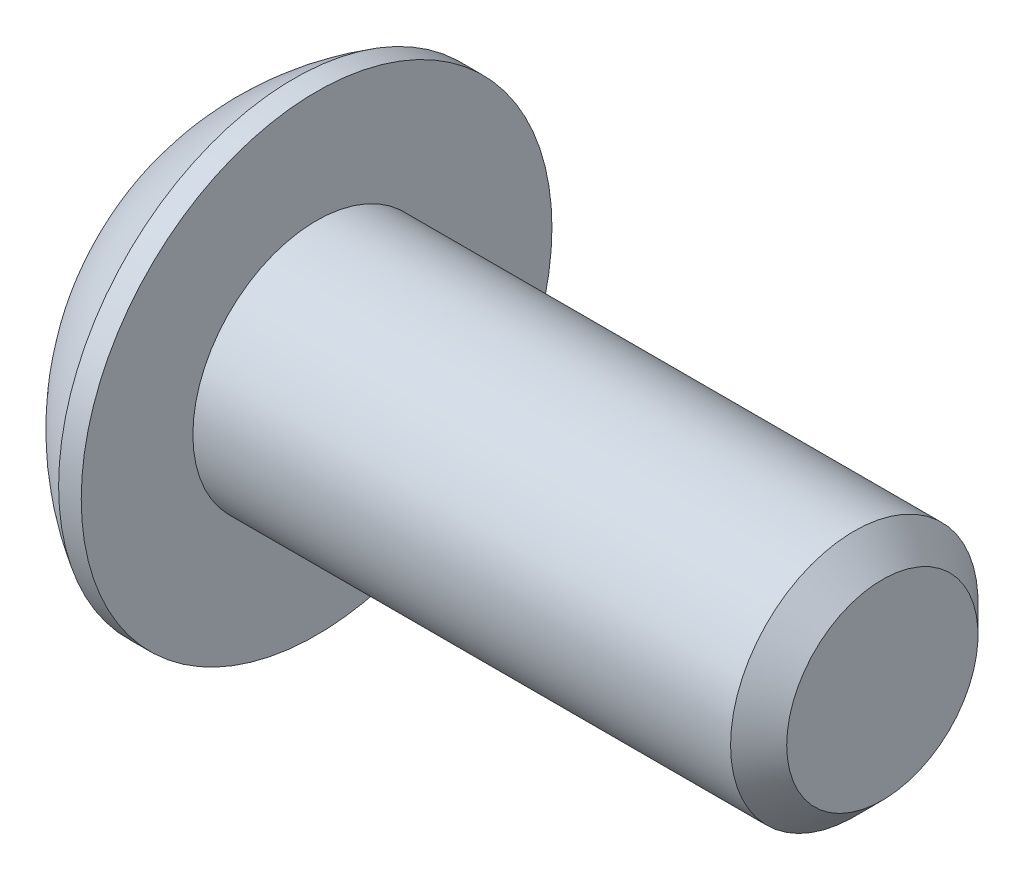
ISO-10303-21;
HEADER;
FILE_DESCRIPTION(('STEP AP214'),'2;1');
FILE_NAME('part.step','',(''),(''),'','','');
FILE_SCHEMA(('AUTOMOTIVE_DESIGN { 1 0 10303 214 1 1 1 1 }'));
ENDSEC;
DATA;
#1=APPLICATION_CONTEXT('core data for automotive mechanical design processes');
#2=APPLICATION_PROTOCOL_DEFINITION('international standard','automotive_design',2000,#1);
#3=PRODUCT_CONTEXT('',#1,'mechanical');
#4=PRODUCT('Part','Part','',(#3));
#5=PRODUCT_RELATED_PRODUCT_CATEGORY('part','',(#4));
#6=PRODUCT_DEFINITION_FORMATION('','',#4);
#7=PRODUCT_DEFINITION_CONTEXT('part definition',#1,'design');
#8=PRODUCT_DEFINITION('design','',#6,#7);
#9=PRODUCT_DEFINITION_SHAPE('','',#8);
#10=(LENGTH_UNIT() NAMED_UNIT(*) SI_UNIT(.MILLI.,.METRE.));
#11=(NAMED_UNIT(*) PLANE_ANGLE_UNIT() SI_UNIT($,.RADIAN.));
#12=(NAMED_UNIT(*) SI_UNIT($,.STERADIAN.) SOLID_ANGLE_UNIT());
#13=UNCERTAINTY_MEASURE_WITH_UNIT(LENGTH_MEASURE(1.E-05),#10,'distance_accuracy_value','');
#14=(GEOMETRIC_REPRESENTATION_CONTEXT(3) GLOBAL_UNCERTAINTY_ASSIGNED_CONTEXT((#13)) GLOBAL_UNIT_ASSIGNED_CONTEXT((#10,
#11,#12)) REPRESENTATION_CONTEXT('',''));
#15=CARTESIAN_POINT('',(0.,0.,0.));
#16=DIRECTION('',(0.,0.,1.));
#17=DIRECTION('',(1.,0.,0.));
#18=AXIS2_PLACEMENT_3D('',#15,#16,#17);
#19=CARTESIAN_POINT('',(1.32079999997359,0.,0.));
#20=DIRECTION('',(-1.,0.,0.));
#21=DIRECTION('',(0.,0.,1.));
#22=AXIS2_PLACEMENT_3D('',#19,#20,#21);
#23=CONICAL_SURFACE('',#22,1.19380000001001,1.04719755119008);
#24=CARTESIAN_POINT('',(2.0100407513155,0.,0.));
#25=VERTEX_POINT('',#24);
#26=VERTEX_LOOP('',#25);
#27=FACE_BOUND('',#26,.T.);
#28=CARTESIAN_POINT('',(1.32079999997359,0.,0.));
#29=DIRECTION('',(-1.,0.,0.));
#30=DIRECTION('',(0.,0.,1.));
#31=AXIS2_PLACEMENT_3D('',#28,#29,#30);
#32=CIRCLE('',#31,1.19380000001001);
#33=CARTESIAN_POINT('',(1.32079999998682,-1.0338611270422,0.596900000002503));
#34=VERTEX_POINT('',#33);
#35=CARTESIAN_POINT('',(1.32079999998682,0.,1.19380000000501));
#36=VERTEX_POINT('',#35);
#37=EDGE_CURVE('E92',#34,#36,#32,.T.);
#38=ORIENTED_EDGE('',*,*,#37,.T.);
#39=CARTESIAN_POINT('',(1.32079999997359,0.,0.));
#40=DIRECTION('',(-1.,0.,0.));
#41=DIRECTION('',(0.,0.,1.));
#42=AXIS2_PLACEMENT_3D('',#39,#40,#41);
#43=CIRCLE('',#42,1.19380000001001);
#44=CARTESIAN_POINT('',(1.32079999998682,1.0338611270422,0.596900000002504));
#45=VERTEX_POINT('',#44);
#46=EDGE_CURVE('E88',#36,#45,#43,.T.);
#47=ORIENTED_EDGE('',*,*,#46,.T.);
#48=CARTESIAN_POINT('',(1.32079999997359,0.,0.));
#49=DIRECTION('',(-1.,0.,0.));
#50=DIRECTION('',(0.,0.,1.));
#51=AXIS2_PLACEMENT_3D('',#48,#49,#50);
#52=CIRCLE('',#51,1.19380000001001);
#53=CARTESIAN_POINT('',(1.32079999998682,1.0338611270422,-0.596900000002504));
#54=VERTEX_POINT('',#53);
#55=EDGE_CURVE('E21',#45,#54,#52,.T.);
#56=ORIENTED_EDGE('',*,*,#55,.T.);
#57=CARTESIAN_POINT('',(1.32079999997359,0.,0.));
#58=DIRECTION('',(-1.,0.,0.));
#59=DIRECTION('',(0.,0.,1.));
#60=AXIS2_PLACEMENT_3D('',#57,#58,#59);
#61=CIRCLE('',#60,1.19380000001001);
#62=CARTESIAN_POINT('',(1.32079999998682,1.49461108489558E-12,-1.19380000000501));
#63=VERTEX_POINT('',#62);
#64=EDGE_CURVE('E151',#54,#63,#61,.T.);
#65=ORIENTED_EDGE('',*,*,#64,.T.);
#66=CARTESIAN_POINT('',(1.32079999997359,0.,0.));
#67=DIRECTION('',(-1.,0.,0.));
#68=DIRECTION('',(0.,0.,1.));
#69=AXIS2_PLACEMENT_3D('',#66,#67,#68);
#70=CIRCLE('',#69,1.19380000001001);
#71=CARTESIAN_POINT('',(1.32079999998682,-1.0338611270422,-0.596900000002503));
#72=VERTEX_POINT('',#71);
#73=EDGE_CURVE('E153',#63,#72,#70,.T.);
#74=ORIENTED_EDGE('',*,*,#73,.T.);
#75=CARTESIAN_POINT('',(1.32079999997359,0.,0.));
#76=DIRECTION('',(-1.,0.,0.));
#77=DIRECTION('',(0.,0.,1.));
#78=AXIS2_PLACEMENT_3D('',#75,#76,#77);
#79=CIRCLE('',#78,1.19380000001001);
#80=EDGE_CURVE('E155',#72,#34,#79,.T.);
#81=ORIENTED_EDGE('',*,*,#80,.T.);
#82=EDGE_LOOP('',(#38,#47,#56,#65,#74,#81));
#83=FACE_BOUND('',#82,.T.);
#84=ADVANCED_FACE('F17',(#27,#83),#23,.F.);
#85=CARTESIAN_POINT('',(1.3208,-2.06772225407572,-1.1938));
#86=DIRECTION('',(1.,0.,0.));
#87=DIRECTION('',(0.,0.,-1.));
#88=AXIS2_PLACEMENT_3D('',#85,#86,#87);
#89=PLANE('',#88);
#90=DIRECTION('',(0.,-0.5,-0.866025403784439));
#91=VECTOR('',#90,1.);
#92=CARTESIAN_POINT('',(1.32080000000004,1.37848150271715,0.));
#93=LINE('',#92,#91);
#94=CARTESIAN_POINT('',(1.32080000000001,1.37848150271715,0.));
#95=VERTEX_POINT('',#94);
#96=EDGE_CURVE('E104',#54,#95,#93,.F.);
#97=ORIENTED_EDGE('',*,*,#96,.F.);
#98=ORIENTED_EDGE('',*,*,#55,.F.);
#99=DIRECTION('',(0.,0.5,-0.866025403784439));
#100=VECTOR('',#99,1.);
#101=CARTESIAN_POINT('',(1.3208,0.689240751358576,1.1938));
#102=LINE('',#101,#100);
#103=EDGE_CURVE('E102',#95,#45,#102,.F.);
#104=ORIENTED_EDGE('',*,*,#103,.F.);
#105=EDGE_LOOP('',(#97,#98,#104));
#106=FACE_BOUND('',#105,.T.);
#107=ADVANCED_FACE('F100',(#106),#89,.F.);
#108=CARTESIAN_POINT('',(1.3208,-2.06772225407572,-1.1938));
#109=DIRECTION('',(1.,0.,0.));
#110=DIRECTION('',(0.,0.,-1.));
#111=AXIS2_PLACEMENT_3D('',#108,#109,#110);
#112=PLANE('',#111);
#113=DIRECTION('',(0.,0.5,-0.866025403784439));
#114=VECTOR('',#113,1.);
#115=CARTESIAN_POINT('',(1.32080000000004,0.689240751358576,1.1938));
#116=LINE('',#115,#114);
#117=CARTESIAN_POINT('',(1.32080000000001,0.689240751358576,1.1938));
#118=VERTEX_POINT('',#117);
#119=EDGE_CURVE('E106',#45,#118,#116,.F.);
#120=ORIENTED_EDGE('',*,*,#119,.F.);
#121=ORIENTED_EDGE('',*,*,#46,.F.);
#122=DIRECTION('',(0.,1.,0.));
#123=VECTOR('',#122,1.);
#124=CARTESIAN_POINT('',(1.3208,-0.689240751358574,1.1938));
#125=LINE('',#124,#123);
#126=EDGE_CURVE('E109',#118,#36,#125,.F.);
#127=ORIENTED_EDGE('',*,*,#126,.F.);
#128=EDGE_LOOP('',(#120,#121,#127));
#129=FACE_BOUND('',#128,.T.);
#130=ADVANCED_FACE('F107',(#129),#112,.F.);
#131=CARTESIAN_POINT('',(1.3208,-2.06772225407572,-1.1938));
#132=DIRECTION('',(1.,0.,0.));
#133=DIRECTION('',(0.,0.,-1.));
#134=AXIS2_PLACEMENT_3D('',#131,#132,#133);
#135=PLANE('',#134);
#136=DIRECTION('',(0.,1.,0.));
#137=VECTOR('',#136,1.);
#138=CARTESIAN_POINT('',(1.32080000000004,-0.689240751358574,1.1938));
#139=LINE('',#138,#137);
#140=CARTESIAN_POINT('',(1.32080000000001,-0.689240751358574,1.1938));
#141=VERTEX_POINT('',#140);
#142=EDGE_CURVE('E169',#36,#141,#139,.F.);
#143=ORIENTED_EDGE('',*,*,#142,.F.);
#144=ORIENTED_EDGE('',*,*,#37,.F.);
#145=DIRECTION('',(0.,0.5,0.866025403784439));
#146=VECTOR('',#145,1.);
#147=CARTESIAN_POINT('',(1.3208,-1.37848150271715,0.));
#148=LINE('',#147,#146);
#149=EDGE_CURVE('E167',#141,#34,#148,.F.);
#150=ORIENTED_EDGE('',*,*,#149,.F.);
#151=EDGE_LOOP('',(#143,#144,#150));
#152=FACE_BOUND('',#151,.T.);
#153=ADVANCED_FACE('F165',(#152),#135,.F.);
#154=CARTESIAN_POINT('',(1.3208,-2.06772225407572,-1.1938));
#155=DIRECTION('',(1.,0.,0.));
#156=DIRECTION('',(0.,0.,-1.));
#157=AXIS2_PLACEMENT_3D('',#154,#155,#156);
#158=PLANE('',#157);
#159=DIRECTION('',(0.,0.5,0.866025403784439));
#160=VECTOR('',#159,1.);
#161=CARTESIAN_POINT('',(1.32080000000004,-1.37848150271715,0.));
#162=LINE('',#161,#160);
#163=CARTESIAN_POINT('',(1.32080000000001,-1.37848150271715,0.));
#164=VERTEX_POINT('',#163);
#165=EDGE_CURVE('E170',#34,#164,#162,.F.);
#166=ORIENTED_EDGE('',*,*,#165,.F.);
#167=ORIENTED_EDGE('',*,*,#80,.F.);
#168=DIRECTION('',(0.,-0.5,0.866025403784439));
#169=VECTOR('',#168,1.);
#170=CARTESIAN_POINT('',(1.3208,-0.689240751358574,-1.1938));
#171=LINE('',#170,#169);
#172=EDGE_CURVE('E173',#164,#72,#171,.F.);
#173=ORIENTED_EDGE('',*,*,#172,.F.);
#174=EDGE_LOOP('',(#166,#167,#173));
#175=FACE_BOUND('',#174,.T.);
#176=ADVANCED_FACE('F171',(#175),#158,.F.);
#177=CARTESIAN_POINT('',(1.3208,-2.06772225407572,-1.1938));
#178=DIRECTION('',(1.,0.,0.));
#179=DIRECTION('',(0.,0.,-1.));
#180=AXIS2_PLACEMENT_3D('',#177,#178,#179);
#181=PLANE('',#180);
#182=DIRECTION('',(0.,-0.5,0.866025403784439));
#183=VECTOR('',#182,1.);
#184=CARTESIAN_POINT('',(1.32080000000004,-0.689240751358574,-1.1938));
#185=LINE('',#184,#183);
#186=CARTESIAN_POINT('',(1.32080000000001,-0.689240751358574,-1.1938));
#187=VERTEX_POINT('',#186);
#188=EDGE_CURVE('E228',#72,#187,#185,.F.);
#189=ORIENTED_EDGE('',*,*,#188,.F.);
#190=ORIENTED_EDGE('',*,*,#73,.F.);
#191=DIRECTION('',(0.,1.,0.));
#192=VECTOR('',#191,1.);
#193=CARTESIAN_POINT('',(1.3208,0.689240751358577,-1.1938));
#194=LINE('',#193,#192);
#195=EDGE_CURVE('E240',#187,#63,#194,.T.);
#196=ORIENTED_EDGE('',*,*,#195,.F.);
#197=EDGE_LOOP('',(#189,#190,#196));
#198=FACE_BOUND('',#197,.T.);
#199=ADVANCED_FACE('F390',(#198),#181,.F.);
#200=CARTESIAN_POINT('',(1.3208,-2.06772225407572,-1.1938));
#201=DIRECTION('',(1.,0.,0.));
#202=DIRECTION('',(0.,0.,-1.));
#203=AXIS2_PLACEMENT_3D('',#200,#201,#202);
#204=PLANE('',#203);
#205=DIRECTION('',(0.,1.,0.));
#206=VECTOR('',#205,1.);
#207=CARTESIAN_POINT('',(1.32080000000004,0.689240751358577,-1.1938));
#208=LINE('',#207,#206);
#209=CARTESIAN_POINT('',(1.32080000000002,0.689240751358565,-1.19380000000002));
#210=VERTEX_POINT('',#209);
#211=EDGE_CURVE('E248',#63,#210,#208,.T.);
#212=ORIENTED_EDGE('',*,*,#211,.F.);
#213=ORIENTED_EDGE('',*,*,#64,.F.);
#214=DIRECTION('',(0.,-0.5,-0.866025403784439));
#215=VECTOR('',#214,1.);
#216=CARTESIAN_POINT('',(1.3208,1.37848150271715,0.));
#217=LINE('',#216,#215);
#218=EDGE_CURVE('E128',#210,#54,#217,.F.);
#219=ORIENTED_EDGE('',*,*,#218,.F.);
#220=EDGE_LOOP('',(#212,#213,#219));
#221=FACE_BOUND('',#220,.T.);
#222=ADVANCED_FACE('F380',(#221),#204,.F.);
#223=CARTESIAN_POINT('',(1.3208,1.37848150271715,0.));
#224=DIRECTION('',(0.,-0.866025403784439,0.5));
#225=DIRECTION('',(0.,-0.5,-0.866025403784439));
#226=AXIS2_PLACEMENT_3D('',#223,#224,#225);
#227=PLANE('',#226);
#228=ORIENTED_EDGE('',*,*,#96,.T.);
#229=DIRECTION('',(1.,0.,0.));
#230=VECTOR('',#229,1.);
#231=CARTESIAN_POINT('',(1.3208,1.37848150271715,0.));
#232=LINE('',#231,#230);
#233=CARTESIAN_POINT('',(0.,1.37848150271715,0.));
#234=VERTEX_POINT('',#233);
#235=EDGE_CURVE('E116',#234,#95,#232,.T.);
#236=ORIENTED_EDGE('',*,*,#235,.F.);
#237=DIRECTION('',(0.,0.5,0.866025403784439));
#238=VECTOR('',#237,1.);
#239=CARTESIAN_POINT('',(0.,0.689240751358577,-1.1938));
#240=LINE('',#239,#238);
#241=CARTESIAN_POINT('',(0.,0.689240751358577,-1.1938));
#242=VERTEX_POINT('',#241);
#243=EDGE_CURVE('E131',#242,#234,#240,.T.);
#244=ORIENTED_EDGE('',*,*,#243,.F.);
#245=DIRECTION('',(1.,0.,0.));
#246=VECTOR('',#245,1.);
#247=CARTESIAN_POINT('',(1.3208,0.689240751358577,-1.1938));
#248=LINE('',#247,#246);
#249=EDGE_CURVE('E135',#210,#242,#248,.F.);
#250=ORIENTED_EDGE('',*,*,#249,.F.);
#251=ORIENTED_EDGE('',*,*,#218,.T.);
#252=EDGE_LOOP('',(#228,#236,#244,#250,#251));
#253=FACE_BOUND('',#252,.T.);
#254=ADVANCED_FACE('F371',(#253),#227,.T.);
#255=CARTESIAN_POINT('',(1.3208,0.689240751358576,1.1938));
#256=DIRECTION('',(0.,-0.866025403784439,-0.5));
#257=DIRECTION('',(0.,0.5,-0.866025403784439));
#258=AXIS2_PLACEMENT_3D('',#255,#256,#257);
#259=PLANE('',#258);
#260=ORIENTED_EDGE('',*,*,#119,.T.);
#261=DIRECTION('',(1.,0.,0.));
#262=VECTOR('',#261,1.);
#263=CARTESIAN_POINT('',(1.3208,0.689240751358576,1.1938));
#264=LINE('',#263,#262);
#265=CARTESIAN_POINT('',(0.,0.689240751358577,1.1938));
#266=VERTEX_POINT('',#265);
#267=EDGE_CURVE('E112',#266,#118,#264,.T.);
#268=ORIENTED_EDGE('',*,*,#267,.F.);
#269=DIRECTION('',(0.,-0.5,0.866025403784439));
#270=VECTOR('',#269,1.);
#271=CARTESIAN_POINT('',(0.,1.37848150271715,0.));
#272=LINE('',#271,#270);
#273=EDGE_CURVE('E134',#234,#266,#272,.T.);
#274=ORIENTED_EDGE('',*,*,#273,.F.);
#275=ORIENTED_EDGE('',*,*,#235,.T.);
#276=ORIENTED_EDGE('',*,*,#103,.T.);
#277=EDGE_LOOP('',(#260,#268,#274,#275,#276));
#278=FACE_BOUND('',#277,.T.);
#279=ADVANCED_FACE('F114',(#278),#259,.T.);
#280=CARTESIAN_POINT('',(1.3208,-0.689240751358574,1.1938));
#281=DIRECTION('',(0.,0.,-1.));
#282=DIRECTION('',(0.,1.,0.));
#283=AXIS2_PLACEMENT_3D('',#280,#281,#282);
#284=PLANE('',#283);
#285=ORIENTED_EDGE('',*,*,#142,.T.);
#286=DIRECTION('',(1.,0.,0.));
#287=VECTOR('',#286,1.);
#288=CARTESIAN_POINT('',(1.3208,-0.689240751358574,1.1938));
#289=LINE('',#288,#287);
#290=CARTESIAN_POINT('',(0.,-0.689240751358574,1.1938));
#291=VERTEX_POINT('',#290);
#292=EDGE_CURVE('E180',#291,#141,#289,.T.);
#293=ORIENTED_EDGE('',*,*,#292,.F.);
#294=DIRECTION('',(0.,1.,0.));
#295=VECTOR('',#294,1.);
#296=CARTESIAN_POINT('',(0.,0.,1.1938));
#297=LINE('',#296,#295);
#298=EDGE_CURVE('E194',#266,#291,#297,.F.);
#299=ORIENTED_EDGE('',*,*,#298,.F.);
#300=ORIENTED_EDGE('',*,*,#267,.T.);
#301=ORIENTED_EDGE('',*,*,#126,.T.);
#302=EDGE_LOOP('',(#285,#293,#299,#300,#301));
#303=FACE_BOUND('',#302,.T.);
#304=ADVANCED_FACE('F216',(#303),#284,.T.);
#305=CARTESIAN_POINT('',(1.3208,-1.37848150271715,0.));
#306=DIRECTION('',(0.,0.866025403784439,-0.5));
#307=DIRECTION('',(0.,0.5,0.866025403784439));
#308=AXIS2_PLACEMENT_3D('',#305,#306,#307);
#309=PLANE('',#308);
#310=ORIENTED_EDGE('',*,*,#165,.T.);
#311=DIRECTION('',(1.,0.,0.));
#312=VECTOR('',#311,1.);
#313=CARTESIAN_POINT('',(1.3208,-1.37848150271715,0.));
#314=LINE('',#313,#312);
#315=CARTESIAN_POINT('',(0.,-1.37848150271715,0.));
#316=VERTEX_POINT('',#315);
#317=EDGE_CURVE('E176',#316,#164,#314,.T.);
#318=ORIENTED_EDGE('',*,*,#317,.F.);
#319=DIRECTION('',(0.,-0.5,-0.866025403784439));
#320=VECTOR('',#319,1.);
#321=CARTESIAN_POINT('',(0.,-0.689240751358574,1.1938));
#322=LINE('',#321,#320);
#323=EDGE_CURVE('E197',#291,#316,#322,.T.);
#324=ORIENTED_EDGE('',*,*,#323,.F.);
#325=ORIENTED_EDGE('',*,*,#292,.T.);
#326=ORIENTED_EDGE('',*,*,#149,.T.);
#327=EDGE_LOOP('',(#310,#318,#324,#325,#326));
#328=FACE_BOUND('',#327,.T.);
#329=ADVANCED_FACE('F178',(#328),#309,.T.);
#330=CARTESIAN_POINT('',(1.3208,-0.689240751358574,-1.1938));
#331=DIRECTION('',(0.,0.866025403784439,0.5));
#332=DIRECTION('',(0.,-0.5,0.866025403784439));
#333=AXIS2_PLACEMENT_3D('',#330,#331,#332);
#334=PLANE('',#333);
#335=ORIENTED_EDGE('',*,*,#188,.T.);
#336=DIRECTION('',(1.,0.,0.));
#337=VECTOR('',#336,1.);
#338=CARTESIAN_POINT('',(1.3208,-0.689240751358574,-1.1938));
#339=LINE('',#338,#337);
#340=CARTESIAN_POINT('',(0.,-0.689240751358574,-1.1938));
#341=VERTEX_POINT('',#340);
#342=EDGE_CURVE('E36',#341,#187,#339,.T.);
#343=ORIENTED_EDGE('',*,*,#342,.F.);
#344=DIRECTION('',(0.,0.5,-0.866025403784439));
#345=VECTOR('',#344,1.);
#346=CARTESIAN_POINT('',(0.,-1.37848150271715,0.));
#347=LINE('',#346,#345);
#348=EDGE_CURVE('E217',#316,#341,#347,.T.);
#349=ORIENTED_EDGE('',*,*,#348,.F.);
#350=ORIENTED_EDGE('',*,*,#317,.T.);
#351=ORIENTED_EDGE('',*,*,#172,.T.);
#352=EDGE_LOOP('',(#335,#343,#349,#350,#351));
#353=FACE_BOUND('',#352,.T.);
#354=ADVANCED_FACE('F337',(#353),#334,.T.);
#355=CARTESIAN_POINT('',(1.3208,0.689240751358577,-1.1938));
#356=DIRECTION('',(0.,0.,1.));
#357=DIRECTION('',(1.,0.,0.));
#358=AXIS2_PLACEMENT_3D('',#355,#356,#357);
#359=PLANE('',#358);
#360=ORIENTED_EDGE('',*,*,#211,.T.);
#361=ORIENTED_EDGE('',*,*,#249,.T.);
#362=DIRECTION('',(0.,1.,0.));
#363=VECTOR('',#362,1.);
#364=CARTESIAN_POINT('',(0.,0.,-1.1938));
#365=LINE('',#364,#363);
#366=EDGE_CURVE('E150',#341,#242,#365,.T.);
#367=ORIENTED_EDGE('',*,*,#366,.F.);
#368=ORIENTED_EDGE('',*,*,#342,.T.);
#369=ORIENTED_EDGE('',*,*,#195,.T.);
#370=EDGE_LOOP('',(#360,#361,#367,#368,#369));
#371=FACE_BOUND('',#370,.T.);
#372=ADVANCED_FACE('F328',(#371),#359,.T.);
#373=CARTESIAN_POINT('',(0.,0.,0.));
#374=DIRECTION('',(-1.,0.,0.));
#375=DIRECTION('',(0.,0.,1.));
#376=AXIS2_PLACEMENT_3D('',#373,#374,#375);
#377=PLANE('',#376);
#378=CARTESIAN_POINT('',(0.,0.,0.));
#379=DIRECTION('',(-1.,0.,0.));
#380=DIRECTION('',(0.,0.,1.));
#381=AXIS2_PLACEMENT_3D('',#378,#379,#380);
#382=CIRCLE('',#381,1.9812);
#383=CARTESIAN_POINT('',(0.,0.,1.9812));
#384=VERTEX_POINT('',#383);
#385=EDGE_CURVE('E147',#384,#384,#382,.F.);
#386=ORIENTED_EDGE('',*,*,#385,.F.);
#387=EDGE_LOOP('',(#386));
#388=FACE_BOUND('',#387,.T.);
#389=ORIENTED_EDGE('',*,*,#348,.T.);
#390=ORIENTED_EDGE('',*,*,#366,.T.);
#391=ORIENTED_EDGE('',*,*,#243,.T.);
#392=ORIENTED_EDGE('',*,*,#273,.T.);
#393=ORIENTED_EDGE('',*,*,#298,.T.);
#394=ORIENTED_EDGE('',*,*,#323,.T.);
#395=EDGE_LOOP('',(#389,#390,#391,#392,#393,#394));
#396=FACE_BOUND('',#395,.T.);
#397=ADVANCED_FACE('F210',(#388,#396),#377,.T.);
#398=CARTESIAN_POINT('',(4.13385,0.,0.));
#399=DIRECTION('',(0.,1.,0.));
#400=DIRECTION('',(-0.489667403954941,0.,-0.871909303485189));
#401=AXIS2_PLACEMENT_3D('',#398,#399,#400);
#402=SPHERICAL_SURFACE('',#401,4.58408870578439);
#403=CARTESIAN_POINT('',(4.13385,0.,0.));
#404=DIRECTION('',(-1.,0.,0.));
#405=DIRECTION('',(0.,0.,1.));
#406=AXIS2_PLACEMENT_3D('',#403,#404,#405);
#407=SPHERICAL_SURFACE('',#406,4.58408870578439);
#408=ORIENTED_EDGE('',*,*,#385,.T.);
#409=EDGE_LOOP('',(#408));
#410=FACE_BOUND('',#409,.T.);
#411=CARTESIAN_POINT('',(1.8288,0.,0.));
#412=DIRECTION('',(-1.,0.,0.));
#413=DIRECTION('',(0.,0.,1.));
#414=AXIS2_PLACEMENT_3D('',#411,#412,#413);
#415=CIRCLE('',#414,3.9624);
#416=CARTESIAN_POINT('',(1.8288,0.,3.9624));
#417=VERTEX_POINT('',#416);
#418=EDGE_CURVE('E144',#417,#417,#415,.F.);
#419=ORIENTED_EDGE('',*,*,#418,.F.);
#420=EDGE_LOOP('',(#419));
#421=FACE_BOUND('',#420,.T.);
#422=ADVANCED_FACE('F19',(#410,#421),#407,.T.);
#423=CARTESIAN_POINT('',(11.7348,0.,0.));
#424=DIRECTION('',(-1.,0.,0.));
#425=DIRECTION('',(0.,0.,1.));
#426=AXIS2_PLACEMENT_3D('',#423,#424,#425);
#427=PLANE('',#426);
#428=CARTESIAN_POINT('',(11.7347999999993,0.,0.));
#429=DIRECTION('',(-1.,0.,0.));
#430=DIRECTION('',(0.,0.,1.));
#431=AXIS2_PLACEMENT_3D('',#428,#429,#430);
#432=CIRCLE('',#431,1.61035999997239);
#433=CARTESIAN_POINT('',(11.7347999999993,0.,1.61035999997239));
#434=VERTEX_POINT('',#433);
#435=EDGE_CURVE('E141',#434,#434,#432,.T.);
#436=ORIENTED_EDGE('',*,*,#435,.F.);
#437=EDGE_LOOP('',(#436));
#438=FACE_BOUND('',#437,.T.);
#439=ADVANCED_FACE('F270',(#438),#427,.F.);
#440=CARTESIAN_POINT('',(0.,0.,0.));
#441=DIRECTION('',(-1.,0.,0.));
#442=DIRECTION('',(0.,0.,1.));
#443=AXIS2_PLACEMENT_3D('',#440,#441,#442);
#444=CYLINDRICAL_SURFACE('',#443,3.9624);
#445=ORIENTED_EDGE('',*,*,#418,.T.);
#446=EDGE_LOOP('',(#445));
#447=FACE_BOUND('',#446,.T.);
#448=CARTESIAN_POINT('',(2.2098,0.,0.));
#449=DIRECTION('',(-1.,0.,0.));
#450=DIRECTION('',(0.,0.,1.));
#451=AXIS2_PLACEMENT_3D('',#448,#449,#450);
#452=CIRCLE('',#451,3.9624);
#453=CARTESIAN_POINT('',(2.2098,0.,3.9624));
#454=VERTEX_POINT('',#453);
#455=EDGE_CURVE('E138',#454,#454,#452,.T.);
#456=ORIENTED_EDGE('',*,*,#455,.T.);
#457=EDGE_LOOP('',(#456));
#458=FACE_BOUND('',#457,.T.);
#459=ADVANCED_FACE('F266',(#447,#458),#444,.T.);
#460=CARTESIAN_POINT('',(11.2623600001029,0.,0.));
#461=DIRECTION('',(-1.,0.,0.));
#462=DIRECTION('',(0.,0.,1.));
#463=AXIS2_PLACEMENT_3D('',#460,#461,#462);
#464=CONICAL_SURFACE('',#463,2.08279999986871,0.785398163397448);
#465=CARTESIAN_POINT('',(11.26236,0.,0.));
#466=DIRECTION('',(-1.,0.,0.));
#467=DIRECTION('',(0.,0.,1.));
#468=AXIS2_PLACEMENT_3D('',#465,#466,#467);
#469=CIRCLE('',#468,2.0828);
#470=CARTESIAN_POINT('',(11.26236,0.,2.0828));
#471=VERTEX_POINT('',#470);
#472=EDGE_CURVE('E27',#471,#471,#469,.T.);
#473=ORIENTED_EDGE('',*,*,#472,.F.);
#474=EDGE_LOOP('',(#473));
#475=FACE_BOUND('',#474,.T.);
#476=ORIENTED_EDGE('',*,*,#435,.T.);
#477=EDGE_LOOP('',(#476));
#478=FACE_BOUND('',#477,.T.);
#479=ADVANCED_FACE('F262',(#475,#478),#464,.T.);
#480=CARTESIAN_POINT('',(2.2098,2.0828,0.));
#481=DIRECTION('',(-1.,0.,0.));
#482=DIRECTION('',(0.,0.,1.));
#483=AXIS2_PLACEMENT_3D('',#480,#481,#482);
#484=PLANE('',#483);
#485=ORIENTED_EDGE('',*,*,#455,.F.);
#486=EDGE_LOOP('',(#485));
#487=FACE_BOUND('',#486,.T.);
#488=CARTESIAN_POINT('',(2.2098,0.,0.));
#489=DIRECTION('',(-1.,0.,0.));
#490=DIRECTION('',(0.,0.,1.));
#491=AXIS2_PLACEMENT_3D('',#488,#489,#490);
#492=CIRCLE('',#491,2.0828);
#493=CARTESIAN_POINT('',(2.2098,0.,2.0828));
#494=VERTEX_POINT('',#493);
#495=EDGE_CURVE('E11',#494,#494,#492,.F.);
#496=ORIENTED_EDGE('',*,*,#495,.F.);
#497=EDGE_LOOP('',(#496));
#498=FACE_BOUND('',#497,.T.);
#499=ADVANCED_FACE('F265',(#487,#498),#484,.F.);
#500=CARTESIAN_POINT('',(0.,0.,0.));
#501=DIRECTION('',(-1.,0.,0.));
#502=DIRECTION('',(0.,0.,1.));
#503=AXIS2_PLACEMENT_3D('',#500,#501,#502);
#504=CYLINDRICAL_SURFACE('',#503,2.0828);
#505=ORIENTED_EDGE('',*,*,#495,.T.);
#506=EDGE_LOOP('',(#505));
#507=FACE_BOUND('',#506,.T.);
#508=ORIENTED_EDGE('',*,*,#472,.T.);
#509=EDGE_LOOP('',(#508));
#510=FACE_BOUND('',#509,.T.);
#511=ADVANCED_FACE('F260',(#507,#510),#504,.T.);
#512=CLOSED_SHELL('',(#84,#107,#130,#153,#176,#199,#222,#254,#279,#304,#329,#354,#372,#397,#422,
#439,#459,#479,#499,#511));
#513=MANIFOLD_SOLID_BREP('B1',#512);
#514=ADVANCED_BREP_SHAPE_REPRESENTATION('',(#18,#513),#14);
#515=SHAPE_DEFINITION_REPRESENTATION(#9,#514);
ENDSEC;
END-ISO-10303-21;
